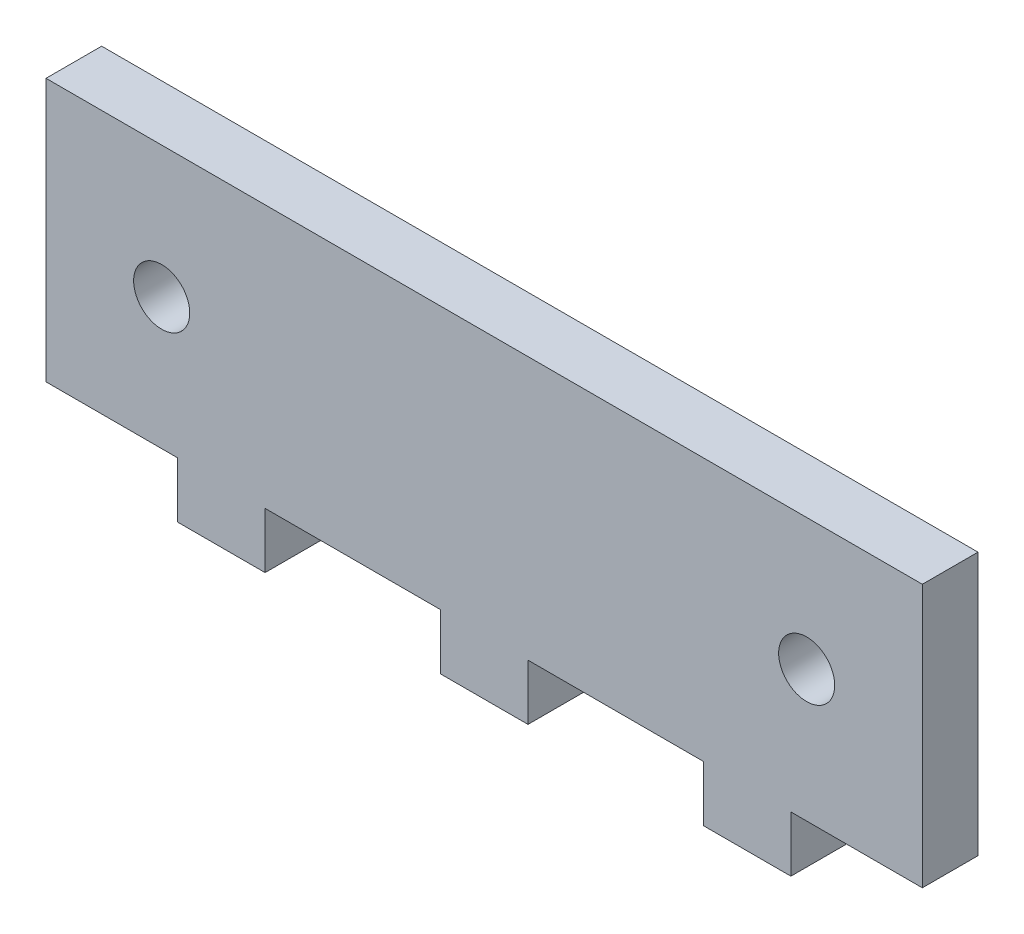
ISO-10303-21;
HEADER;
FILE_DESCRIPTION(('STEP AP214'),'2;1');
FILE_NAME('part.step','',(''),(''),'','','');
FILE_SCHEMA(('AUTOMOTIVE_DESIGN { 1 0 10303 214 1 1 1 1 }'));
ENDSEC;
DATA;
#1=APPLICATION_CONTEXT('core data for automotive mechanical design processes');
#2=APPLICATION_PROTOCOL_DEFINITION('international standard','automotive_design',2000,#1);
#3=PRODUCT_CONTEXT('',#1,'mechanical');
#4=PRODUCT('Part','Part','',(#3));
#5=PRODUCT_RELATED_PRODUCT_CATEGORY('part','',(#4));
#6=PRODUCT_DEFINITION_FORMATION('','',#4);
#7=PRODUCT_DEFINITION_CONTEXT('part definition',#1,'design');
#8=PRODUCT_DEFINITION('design','',#6,#7);
#9=PRODUCT_DEFINITION_SHAPE('','',#8);
#10=(LENGTH_UNIT() NAMED_UNIT(*) SI_UNIT(.MILLI.,.METRE.));
#11=(NAMED_UNIT(*) PLANE_ANGLE_UNIT() SI_UNIT($,.RADIAN.));
#12=(NAMED_UNIT(*) SI_UNIT($,.STERADIAN.) SOLID_ANGLE_UNIT());
#13=UNCERTAINTY_MEASURE_WITH_UNIT(LENGTH_MEASURE(1.E-05),#10,'distance_accuracy_value','');
#14=(GEOMETRIC_REPRESENTATION_CONTEXT(3) GLOBAL_UNCERTAINTY_ASSIGNED_CONTEXT((#13)) GLOBAL_UNIT_ASSIGNED_CONTEXT((#10,
#11,#12)) REPRESENTATION_CONTEXT('',''));
#15=CARTESIAN_POINT('',(0.,0.,0.));
#16=DIRECTION('',(0.,0.,1.));
#17=DIRECTION('',(1.,0.,0.));
#18=AXIS2_PLACEMENT_3D('',#15,#16,#17);
#19=CARTESIAN_POINT('',(-17.5,-7.5,3.175));
#20=DIRECTION('',(0.,1.,0.));
#21=DIRECTION('',(-1.,0.,0.));
#22=AXIS2_PLACEMENT_3D('',#19,#20,#21);
#23=PLANE('',#22);
#24=DIRECTION('',(1.,0.,0.));
#25=VECTOR('',#24,1.);
#26=CARTESIAN_POINT('',(-17.5,-7.5,0.));
#27=LINE('',#26,#25);
#28=CARTESIAN_POINT('',(-25.,-7.5,0.));
#29=VERTEX_POINT('',#28);
#30=CARTESIAN_POINT('',(-17.5,-7.5,0.));
#31=VERTEX_POINT('',#30);
#32=EDGE_CURVE('E187',#29,#31,#27,.T.);
#33=ORIENTED_EDGE('',*,*,#32,.T.);
#34=DIRECTION('',(0.,0.,-1.));
#35=VECTOR('',#34,1.);
#36=CARTESIAN_POINT('',(-17.5,-7.5,3.175));
#37=LINE('',#36,#35);
#38=CARTESIAN_POINT('',(-17.5,-7.5,3.175));
#39=VERTEX_POINT('',#38);
#40=EDGE_CURVE('E11',#39,#31,#37,.T.);
#41=ORIENTED_EDGE('',*,*,#40,.F.);
#42=DIRECTION('',(1.,0.,0.));
#43=VECTOR('',#42,1.);
#44=CARTESIAN_POINT('',(-17.5,-7.5,3.175));
#45=LINE('',#44,#43);
#46=CARTESIAN_POINT('',(-25.,-7.5,3.175));
#47=VERTEX_POINT('',#46);
#48=EDGE_CURVE('E234',#47,#39,#45,.T.);
#49=ORIENTED_EDGE('',*,*,#48,.F.);
#50=DIRECTION('',(0.,0.,-1.));
#51=VECTOR('',#50,1.);
#52=CARTESIAN_POINT('',(-25.,-7.5,3.175));
#53=LINE('',#52,#51);
#54=EDGE_CURVE('E183',#47,#29,#53,.T.);
#55=ORIENTED_EDGE('',*,*,#54,.T.);
#56=EDGE_LOOP('',(#33,#41,#49,#55));
#57=FACE_BOUND('',#56,.T.);
#58=ADVANCED_FACE('F38',(#57),#23,.F.);
#59=CARTESIAN_POINT('',(-17.5,-7.5,3.175));
#60=DIRECTION('',(1.,0.,0.));
#61=DIRECTION('',(0.,0.,-1.));
#62=AXIS2_PLACEMENT_3D('',#59,#60,#61);
#63=PLANE('',#62);
#64=DIRECTION('',(0.,-1.,0.));
#65=VECTOR('',#64,1.);
#66=CARTESIAN_POINT('',(-17.5,-7.5,0.));
#67=LINE('',#66,#65);
#68=CARTESIAN_POINT('',(-17.5,-10.675,0.));
#69=VERTEX_POINT('',#68);
#70=EDGE_CURVE('E191',#31,#69,#67,.T.);
#71=ORIENTED_EDGE('',*,*,#70,.T.);
#72=DIRECTION('',(0.,0.,-1.));
#73=VECTOR('',#72,1.);
#74=CARTESIAN_POINT('',(-17.5,-10.675,3.175));
#75=LINE('',#74,#73);
#76=CARTESIAN_POINT('',(-17.5,-10.675,3.175));
#77=VERTEX_POINT('',#76);
#78=EDGE_CURVE('E47',#77,#69,#75,.T.);
#79=ORIENTED_EDGE('',*,*,#78,.F.);
#80=DIRECTION('',(0.,-1.,0.));
#81=VECTOR('',#80,1.);
#82=CARTESIAN_POINT('',(-17.5,-7.5,3.175));
#83=LINE('',#82,#81);
#84=EDGE_CURVE('E122',#39,#77,#83,.T.);
#85=ORIENTED_EDGE('',*,*,#84,.F.);
#86=ORIENTED_EDGE('',*,*,#40,.T.);
#87=EDGE_LOOP('',(#71,#79,#85,#86));
#88=FACE_BOUND('',#87,.T.);
#89=ADVANCED_FACE('F358',(#88),#63,.F.);
#90=CARTESIAN_POINT('',(-17.5,-10.675,3.175));
#91=DIRECTION('',(0.,1.,0.));
#92=DIRECTION('',(-1.,0.,0.));
#93=AXIS2_PLACEMENT_3D('',#90,#91,#92);
#94=PLANE('',#93);
#95=DIRECTION('',(1.,0.,0.));
#96=VECTOR('',#95,1.);
#97=CARTESIAN_POINT('',(-17.5,-10.675,0.));
#98=LINE('',#97,#96);
#99=CARTESIAN_POINT('',(-12.5,-10.675,0.));
#100=VERTEX_POINT('',#99);
#101=EDGE_CURVE('E195',#69,#100,#98,.T.);
#102=ORIENTED_EDGE('',*,*,#101,.T.);
#103=DIRECTION('',(0.,0.,-1.));
#104=VECTOR('',#103,1.);
#105=CARTESIAN_POINT('',(-12.5,-10.675,3.175));
#106=LINE('',#105,#104);
#107=CARTESIAN_POINT('',(-12.5,-10.675,3.175));
#108=VERTEX_POINT('',#107);
#109=EDGE_CURVE('E277',#108,#100,#106,.T.);
#110=ORIENTED_EDGE('',*,*,#109,.F.);
#111=DIRECTION('',(1.,0.,0.));
#112=VECTOR('',#111,1.);
#113=CARTESIAN_POINT('',(-17.5,-10.675,3.175));
#114=LINE('',#113,#112);
#115=EDGE_CURVE('E287',#77,#108,#114,.T.);
#116=ORIENTED_EDGE('',*,*,#115,.F.);
#117=ORIENTED_EDGE('',*,*,#78,.T.);
#118=EDGE_LOOP('',(#102,#110,#116,#117));
#119=FACE_BOUND('',#118,.T.);
#120=ADVANCED_FACE('F285',(#119),#94,.F.);
#121=CARTESIAN_POINT('',(-12.5,-7.5,3.175));
#122=DIRECTION('',(-1.,0.,0.));
#123=DIRECTION('',(0.,0.,1.));
#124=AXIS2_PLACEMENT_3D('',#121,#122,#123);
#125=PLANE('',#124);
#126=DIRECTION('',(0.,1.,0.));
#127=VECTOR('',#126,1.);
#128=CARTESIAN_POINT('',(-12.5,-7.5,0.));
#129=LINE('',#128,#127);
#130=CARTESIAN_POINT('',(-12.5,-7.5,0.));
#131=VERTEX_POINT('',#130);
#132=EDGE_CURVE('E198',#100,#131,#129,.T.);
#133=ORIENTED_EDGE('',*,*,#132,.T.);
#134=DIRECTION('',(0.,0.,-1.));
#135=VECTOR('',#134,1.);
#136=CARTESIAN_POINT('',(-12.5,-7.5,3.175));
#137=LINE('',#136,#135);
#138=CARTESIAN_POINT('',(-12.5,-7.5,3.175));
#139=VERTEX_POINT('',#138);
#140=EDGE_CURVE('E273',#139,#131,#137,.T.);
#141=ORIENTED_EDGE('',*,*,#140,.F.);
#142=DIRECTION('',(0.,1.,0.));
#143=VECTOR('',#142,1.);
#144=CARTESIAN_POINT('',(-12.5,-7.5,3.175));
#145=LINE('',#144,#143);
#146=EDGE_CURVE('E306',#108,#139,#145,.T.);
#147=ORIENTED_EDGE('',*,*,#146,.F.);
#148=ORIENTED_EDGE('',*,*,#109,.T.);
#149=EDGE_LOOP('',(#133,#141,#147,#148));
#150=FACE_BOUND('',#149,.T.);
#151=ADVANCED_FACE('F296',(#150),#125,.F.);
#152=CARTESIAN_POINT('',(-2.49999999999998,-7.5,3.175));
#153=DIRECTION('',(0.,1.,0.));
#154=DIRECTION('',(-1.,0.,0.));
#155=AXIS2_PLACEMENT_3D('',#152,#153,#154);
#156=PLANE('',#155);
#157=DIRECTION('',(1.,0.,0.));
#158=VECTOR('',#157,1.);
#159=CARTESIAN_POINT('',(-2.49999999999998,-7.5,0.));
#160=LINE('',#159,#158);
#161=CARTESIAN_POINT('',(-2.49999999999998,-7.5,0.));
#162=VERTEX_POINT('',#161);
#163=EDGE_CURVE('E201',#131,#162,#160,.T.);
#164=ORIENTED_EDGE('',*,*,#163,.T.);
#165=DIRECTION('',(0.,0.,-1.));
#166=VECTOR('',#165,1.);
#167=CARTESIAN_POINT('',(-2.49999999999998,-7.5,3.175));
#168=LINE('',#167,#166);
#169=CARTESIAN_POINT('',(-2.49999999999998,-7.5,3.175));
#170=VERTEX_POINT('',#169);
#171=EDGE_CURVE('E269',#170,#162,#168,.T.);
#172=ORIENTED_EDGE('',*,*,#171,.F.);
#173=DIRECTION('',(1.,0.,0.));
#174=VECTOR('',#173,1.);
#175=CARTESIAN_POINT('',(-2.49999999999998,-7.5,3.175));
#176=LINE('',#175,#174);
#177=EDGE_CURVE('E302',#139,#170,#176,.T.);
#178=ORIENTED_EDGE('',*,*,#177,.F.);
#179=ORIENTED_EDGE('',*,*,#140,.T.);
#180=EDGE_LOOP('',(#164,#172,#178,#179));
#181=FACE_BOUND('',#180,.T.);
#182=ADVANCED_FACE('F300',(#181),#156,.F.);
#183=CARTESIAN_POINT('',(-2.49999999999998,-7.5,3.175));
#184=DIRECTION('',(1.,0.,0.));
#185=DIRECTION('',(0.,1.,0.));
#186=AXIS2_PLACEMENT_3D('',#183,#184,#185);
#187=PLANE('',#186);
#188=DIRECTION('',(0.,-1.,0.));
#189=VECTOR('',#188,1.);
#190=CARTESIAN_POINT('',(-2.49999999999998,-7.5,0.));
#191=LINE('',#190,#189);
#192=CARTESIAN_POINT('',(-2.49999999999998,-10.675,0.));
#193=VERTEX_POINT('',#192);
#194=EDGE_CURVE('E204',#162,#193,#191,.T.);
#195=ORIENTED_EDGE('',*,*,#194,.T.);
#196=DIRECTION('',(0.,0.,-1.));
#197=VECTOR('',#196,1.);
#198=CARTESIAN_POINT('',(-2.49999999999998,-10.675,3.175));
#199=LINE('',#198,#197);
#200=CARTESIAN_POINT('',(-2.49999999999998,-10.675,3.175));
#201=VERTEX_POINT('',#200);
#202=EDGE_CURVE('E265',#201,#193,#199,.T.);
#203=ORIENTED_EDGE('',*,*,#202,.F.);
#204=DIRECTION('',(0.,-1.,0.));
#205=VECTOR('',#204,1.);
#206=CARTESIAN_POINT('',(-2.49999999999998,-7.5,3.175));
#207=LINE('',#206,#205);
#208=EDGE_CURVE('E305',#170,#201,#207,.T.);
#209=ORIENTED_EDGE('',*,*,#208,.F.);
#210=ORIENTED_EDGE('',*,*,#171,.T.);
#211=EDGE_LOOP('',(#195,#203,#209,#210));
#212=FACE_BOUND('',#211,.T.);
#213=ADVANCED_FACE('F371',(#212),#187,.F.);
#214=CARTESIAN_POINT('',(-2.49999999999998,-10.675,3.175));
#215=DIRECTION('',(0.,1.,0.));
#216=DIRECTION('',(-1.,0.,0.));
#217=AXIS2_PLACEMENT_3D('',#214,#215,#216);
#218=PLANE('',#217);
#219=DIRECTION('',(1.,0.,0.));
#220=VECTOR('',#219,1.);
#221=CARTESIAN_POINT('',(-2.49999999999998,-10.675,0.));
#222=LINE('',#221,#220);
#223=CARTESIAN_POINT('',(2.50000000000002,-10.675,0.));
#224=VERTEX_POINT('',#223);
#225=EDGE_CURVE('E207',#193,#224,#222,.T.);
#226=ORIENTED_EDGE('',*,*,#225,.T.);
#227=DIRECTION('',(0.,0.,-1.));
#228=VECTOR('',#227,1.);
#229=CARTESIAN_POINT('',(2.50000000000002,-10.675,3.175));
#230=LINE('',#229,#228);
#231=CARTESIAN_POINT('',(2.50000000000002,-10.675,3.175));
#232=VERTEX_POINT('',#231);
#233=EDGE_CURVE('E261',#232,#224,#230,.T.);
#234=ORIENTED_EDGE('',*,*,#233,.F.);
#235=DIRECTION('',(1.,0.,0.));
#236=VECTOR('',#235,1.);
#237=CARTESIAN_POINT('',(-2.49999999999998,-10.675,3.175));
#238=LINE('',#237,#236);
#239=EDGE_CURVE('E310',#201,#232,#238,.T.);
#240=ORIENTED_EDGE('',*,*,#239,.F.);
#241=ORIENTED_EDGE('',*,*,#202,.T.);
#242=EDGE_LOOP('',(#226,#234,#240,#241));
#243=FACE_BOUND('',#242,.T.);
#244=ADVANCED_FACE('F374',(#243),#218,.F.);
#245=CARTESIAN_POINT('',(2.50000000000002,-7.5,3.175));
#246=DIRECTION('',(-1.,0.,0.));
#247=DIRECTION('',(0.,-1.,0.));
#248=AXIS2_PLACEMENT_3D('',#245,#246,#247);
#249=PLANE('',#248);
#250=DIRECTION('',(0.,1.,0.));
#251=VECTOR('',#250,1.);
#252=CARTESIAN_POINT('',(2.50000000000002,-7.5,0.));
#253=LINE('',#252,#251);
#254=CARTESIAN_POINT('',(2.50000000000002,-7.5,0.));
#255=VERTEX_POINT('',#254);
#256=EDGE_CURVE('E210',#224,#255,#253,.T.);
#257=ORIENTED_EDGE('',*,*,#256,.T.);
#258=DIRECTION('',(0.,0.,-1.));
#259=VECTOR('',#258,1.);
#260=CARTESIAN_POINT('',(2.50000000000002,-7.5,3.175));
#261=LINE('',#260,#259);
#262=CARTESIAN_POINT('',(2.50000000000002,-7.5,3.175));
#263=VERTEX_POINT('',#262);
#264=EDGE_CURVE('E257',#263,#255,#261,.T.);
#265=ORIENTED_EDGE('',*,*,#264,.F.);
#266=DIRECTION('',(0.,1.,0.));
#267=VECTOR('',#266,1.);
#268=CARTESIAN_POINT('',(2.50000000000002,-7.5,3.175));
#269=LINE('',#268,#267);
#270=EDGE_CURVE('E317',#232,#263,#269,.T.);
#271=ORIENTED_EDGE('',*,*,#270,.F.);
#272=ORIENTED_EDGE('',*,*,#233,.T.);
#273=EDGE_LOOP('',(#257,#265,#271,#272));
#274=FACE_BOUND('',#273,.T.);
#275=ADVANCED_FACE('F378',(#274),#249,.F.);
#276=CARTESIAN_POINT('',(12.5,-7.5,3.175));
#277=DIRECTION('',(0.,1.,0.));
#278=DIRECTION('',(-1.,0.,0.));
#279=AXIS2_PLACEMENT_3D('',#276,#277,#278);
#280=PLANE('',#279);
#281=DIRECTION('',(1.,0.,0.));
#282=VECTOR('',#281,1.);
#283=CARTESIAN_POINT('',(12.5,-7.5,0.));
#284=LINE('',#283,#282);
#285=CARTESIAN_POINT('',(12.5,-7.5,0.));
#286=VERTEX_POINT('',#285);
#287=EDGE_CURVE('E213',#255,#286,#284,.T.);
#288=ORIENTED_EDGE('',*,*,#287,.T.);
#289=DIRECTION('',(0.,0.,-1.));
#290=VECTOR('',#289,1.);
#291=CARTESIAN_POINT('',(12.5,-7.5,3.175));
#292=LINE('',#291,#290);
#293=CARTESIAN_POINT('',(12.5,-7.5,3.175));
#294=VERTEX_POINT('',#293);
#295=EDGE_CURVE('E253',#294,#286,#292,.T.);
#296=ORIENTED_EDGE('',*,*,#295,.F.);
#297=DIRECTION('',(1.,0.,0.));
#298=VECTOR('',#297,1.);
#299=CARTESIAN_POINT('',(12.5,-7.5,3.175));
#300=LINE('',#299,#298);
#301=EDGE_CURVE('E320',#263,#294,#300,.T.);
#302=ORIENTED_EDGE('',*,*,#301,.F.);
#303=ORIENTED_EDGE('',*,*,#264,.T.);
#304=EDGE_LOOP('',(#288,#296,#302,#303));
#305=FACE_BOUND('',#304,.T.);
#306=ADVANCED_FACE('F382',(#305),#280,.F.);
#307=CARTESIAN_POINT('',(12.5,-7.5,3.175));
#308=DIRECTION('',(1.,0.,0.));
#309=DIRECTION('',(0.,0.,-1.));
#310=AXIS2_PLACEMENT_3D('',#307,#308,#309);
#311=PLANE('',#310);
#312=DIRECTION('',(0.,-1.,0.));
#313=VECTOR('',#312,1.);
#314=CARTESIAN_POINT('',(12.5,-7.5,0.));
#315=LINE('',#314,#313);
#316=CARTESIAN_POINT('',(12.5,-10.675,0.));
#317=VERTEX_POINT('',#316);
#318=EDGE_CURVE('E216',#286,#317,#315,.T.);
#319=ORIENTED_EDGE('',*,*,#318,.T.);
#320=DIRECTION('',(0.,0.,-1.));
#321=VECTOR('',#320,1.);
#322=CARTESIAN_POINT('',(12.5,-10.675,3.175));
#323=LINE('',#322,#321);
#324=CARTESIAN_POINT('',(12.5,-10.675,3.175));
#325=VERTEX_POINT('',#324);
#326=EDGE_CURVE('E249',#325,#317,#323,.T.);
#327=ORIENTED_EDGE('',*,*,#326,.F.);
#328=DIRECTION('',(0.,-1.,0.));
#329=VECTOR('',#328,1.);
#330=CARTESIAN_POINT('',(12.5,-7.5,3.175));
#331=LINE('',#330,#329);
#332=EDGE_CURVE('E323',#294,#325,#331,.T.);
#333=ORIENTED_EDGE('',*,*,#332,.F.);
#334=ORIENTED_EDGE('',*,*,#295,.T.);
#335=EDGE_LOOP('',(#319,#327,#333,#334));
#336=FACE_BOUND('',#335,.T.);
#337=ADVANCED_FACE('F386',(#336),#311,.F.);
#338=CARTESIAN_POINT('',(12.5,-10.675,3.175));
#339=DIRECTION('',(0.,1.,0.));
#340=DIRECTION('',(0.,0.,1.));
#341=AXIS2_PLACEMENT_3D('',#338,#339,#340);
#342=PLANE('',#341);
#343=DIRECTION('',(1.,0.,0.));
#344=VECTOR('',#343,1.);
#345=CARTESIAN_POINT('',(12.5,-10.675,0.));
#346=LINE('',#345,#344);
#347=CARTESIAN_POINT('',(17.5,-10.675,0.));
#348=VERTEX_POINT('',#347);
#349=EDGE_CURVE('E219',#317,#348,#346,.T.);
#350=ORIENTED_EDGE('',*,*,#349,.T.);
#351=DIRECTION('',(0.,0.,-1.));
#352=VECTOR('',#351,1.);
#353=CARTESIAN_POINT('',(17.5,-10.675,3.175));
#354=LINE('',#353,#352);
#355=CARTESIAN_POINT('',(17.5,-10.675,3.175));
#356=VERTEX_POINT('',#355);
#357=EDGE_CURVE('E245',#356,#348,#354,.T.);
#358=ORIENTED_EDGE('',*,*,#357,.F.);
#359=DIRECTION('',(1.,0.,0.));
#360=VECTOR('',#359,1.);
#361=CARTESIAN_POINT('',(12.5,-10.675,3.175));
#362=LINE('',#361,#360);
#363=EDGE_CURVE('E326',#325,#356,#362,.T.);
#364=ORIENTED_EDGE('',*,*,#363,.F.);
#365=ORIENTED_EDGE('',*,*,#326,.T.);
#366=EDGE_LOOP('',(#350,#358,#364,#365));
#367=FACE_BOUND('',#366,.T.);
#368=ADVANCED_FACE('F390',(#367),#342,.F.);
#369=CARTESIAN_POINT('',(17.5,-7.5,3.175));
#370=DIRECTION('',(-1.,0.,0.));
#371=DIRECTION('',(0.,-1.,0.));
#372=AXIS2_PLACEMENT_3D('',#369,#370,#371);
#373=PLANE('',#372);
#374=DIRECTION('',(0.,1.,0.));
#375=VECTOR('',#374,1.);
#376=CARTESIAN_POINT('',(17.5,-7.5,0.));
#377=LINE('',#376,#375);
#378=CARTESIAN_POINT('',(17.5,-7.5,0.));
#379=VERTEX_POINT('',#378);
#380=EDGE_CURVE('E222',#348,#379,#377,.T.);
#381=ORIENTED_EDGE('',*,*,#380,.T.);
#382=DIRECTION('',(0.,0.,-1.));
#383=VECTOR('',#382,1.);
#384=CARTESIAN_POINT('',(17.5,-7.5,3.175));
#385=LINE('',#384,#383);
#386=CARTESIAN_POINT('',(17.5,-7.5,3.175));
#387=VERTEX_POINT('',#386);
#388=EDGE_CURVE('E241',#387,#379,#385,.T.);
#389=ORIENTED_EDGE('',*,*,#388,.F.);
#390=DIRECTION('',(0.,1.,0.));
#391=VECTOR('',#390,1.);
#392=CARTESIAN_POINT('',(17.5,-7.5,3.175));
#393=LINE('',#392,#391);
#394=EDGE_CURVE('E329',#356,#387,#393,.T.);
#395=ORIENTED_EDGE('',*,*,#394,.F.);
#396=ORIENTED_EDGE('',*,*,#357,.T.);
#397=EDGE_LOOP('',(#381,#389,#395,#396));
#398=FACE_BOUND('',#397,.T.);
#399=ADVANCED_FACE('F337',(#398),#373,.F.);
#400=CARTESIAN_POINT('',(25.,-7.5,3.175));
#401=DIRECTION('',(0.,1.,0.));
#402=DIRECTION('',(-1.,0.,0.));
#403=AXIS2_PLACEMENT_3D('',#400,#401,#402);
#404=PLANE('',#403);
#405=DIRECTION('',(1.,0.,0.));
#406=VECTOR('',#405,1.);
#407=CARTESIAN_POINT('',(25.,-7.5,0.));
#408=LINE('',#407,#406);
#409=CARTESIAN_POINT('',(25.,-7.5,0.));
#410=VERTEX_POINT('',#409);
#411=EDGE_CURVE('E225',#379,#410,#408,.T.);
#412=ORIENTED_EDGE('',*,*,#411,.T.);
#413=DIRECTION('',(0.,0.,-1.));
#414=VECTOR('',#413,1.);
#415=CARTESIAN_POINT('',(25.,-7.5,3.175));
#416=LINE('',#415,#414);
#417=CARTESIAN_POINT('',(25.,-7.5,3.175));
#418=VERTEX_POINT('',#417);
#419=EDGE_CURVE('E176',#418,#410,#416,.T.);
#420=ORIENTED_EDGE('',*,*,#419,.F.);
#421=DIRECTION('',(1.,0.,0.));
#422=VECTOR('',#421,1.);
#423=CARTESIAN_POINT('',(25.,-7.5,3.175));
#424=LINE('',#423,#422);
#425=EDGE_CURVE('E165',#387,#418,#424,.T.);
#426=ORIENTED_EDGE('',*,*,#425,.F.);
#427=ORIENTED_EDGE('',*,*,#388,.T.);
#428=EDGE_LOOP('',(#412,#420,#426,#427));
#429=FACE_BOUND('',#428,.T.);
#430=ADVANCED_FACE('F341',(#429),#404,.F.);
#431=CARTESIAN_POINT('',(25.,7.5,3.175));
#432=DIRECTION('',(-1.,0.,0.));
#433=DIRECTION('',(0.,-1.,0.));
#434=AXIS2_PLACEMENT_3D('',#431,#432,#433);
#435=PLANE('',#434);
#436=DIRECTION('',(0.,1.,0.));
#437=VECTOR('',#436,1.);
#438=CARTESIAN_POINT('',(25.,7.5,0.));
#439=LINE('',#438,#437);
#440=CARTESIAN_POINT('',(25.,7.5,0.));
#441=VERTEX_POINT('',#440);
#442=EDGE_CURVE('E174',#410,#441,#439,.T.);
#443=ORIENTED_EDGE('',*,*,#442,.T.);
#444=DIRECTION('',(0.,0.,-1.));
#445=VECTOR('',#444,1.);
#446=CARTESIAN_POINT('',(25.,7.5,3.175));
#447=LINE('',#446,#445);
#448=CARTESIAN_POINT('',(25.,7.5,3.175));
#449=VERTEX_POINT('',#448);
#450=EDGE_CURVE('E171',#449,#441,#447,.T.);
#451=ORIENTED_EDGE('',*,*,#450,.F.);
#452=DIRECTION('',(0.,1.,0.));
#453=VECTOR('',#452,1.);
#454=CARTESIAN_POINT('',(25.,7.5,3.175));
#455=LINE('',#454,#453);
#456=EDGE_CURVE('E159',#418,#449,#455,.T.);
#457=ORIENTED_EDGE('',*,*,#456,.F.);
#458=ORIENTED_EDGE('',*,*,#419,.T.);
#459=EDGE_LOOP('',(#443,#451,#457,#458));
#460=FACE_BOUND('',#459,.T.);
#461=ADVANCED_FACE('F172',(#460),#435,.F.);
#462=CARTESIAN_POINT('',(25.,7.5,3.175));
#463=DIRECTION('',(0.,-1.,0.));
#464=DIRECTION('',(1.,0.,0.));
#465=AXIS2_PLACEMENT_3D('',#462,#463,#464);
#466=PLANE('',#465);
#467=DIRECTION('',(-1.,0.,0.));
#468=VECTOR('',#467,1.);
#469=CARTESIAN_POINT('',(25.,7.5,0.));
#470=LINE('',#469,#468);
#471=CARTESIAN_POINT('',(-25.,7.5,0.));
#472=VERTEX_POINT('',#471);
#473=EDGE_CURVE('E108',#441,#472,#470,.T.);
#474=ORIENTED_EDGE('',*,*,#473,.T.);
#475=DIRECTION('',(0.,0.,-1.));
#476=VECTOR('',#475,1.);
#477=CARTESIAN_POINT('',(-25.,7.5,3.175));
#478=LINE('',#477,#476);
#479=CARTESIAN_POINT('',(-25.,7.5,3.175));
#480=VERTEX_POINT('',#479);
#481=EDGE_CURVE('E177',#480,#472,#478,.T.);
#482=ORIENTED_EDGE('',*,*,#481,.F.);
#483=DIRECTION('',(-1.,0.,0.));
#484=VECTOR('',#483,1.);
#485=CARTESIAN_POINT('',(25.,7.5,3.175));
#486=LINE('',#485,#484);
#487=EDGE_CURVE('E163',#449,#480,#486,.T.);
#488=ORIENTED_EDGE('',*,*,#487,.F.);
#489=ORIENTED_EDGE('',*,*,#450,.T.);
#490=EDGE_LOOP('',(#474,#482,#488,#489));
#491=FACE_BOUND('',#490,.T.);
#492=ADVANCED_FACE('F179',(#491),#466,.F.);
#493=CARTESIAN_POINT('',(-25.,7.5,3.175));
#494=DIRECTION('',(1.,0.,0.));
#495=DIRECTION('',(0.,0.,-1.));
#496=AXIS2_PLACEMENT_3D('',#493,#494,#495);
#497=PLANE('',#496);
#498=DIRECTION('',(0.,-1.,0.));
#499=VECTOR('',#498,1.);
#500=CARTESIAN_POINT('',(-25.,7.5,0.));
#501=LINE('',#500,#499);
#502=EDGE_CURVE('E114',#472,#29,#501,.T.);
#503=ORIENTED_EDGE('',*,*,#502,.T.);
#504=ORIENTED_EDGE('',*,*,#54,.F.);
#505=DIRECTION('',(0.,-1.,0.));
#506=VECTOR('',#505,1.);
#507=CARTESIAN_POINT('',(-25.,7.5,3.175));
#508=LINE('',#507,#506);
#509=EDGE_CURVE('E55',#480,#47,#508,.T.);
#510=ORIENTED_EDGE('',*,*,#509,.F.);
#511=ORIENTED_EDGE('',*,*,#481,.T.);
#512=EDGE_LOOP('',(#503,#504,#510,#511));
#513=FACE_BOUND('',#512,.T.);
#514=ADVANCED_FACE('F345',(#513),#497,.F.);
#515=CARTESIAN_POINT('',(0.,0.,3.175));
#516=DIRECTION('',(0.,0.,1.));
#517=DIRECTION('',(1.,0.,0.));
#518=AXIS2_PLACEMENT_3D('',#515,#516,#517);
#519=PLANE('',#518);
#520=CARTESIAN_POINT('',(-18.4,0.,3.175));
#521=DIRECTION('',(0.,0.,1.));
#522=DIRECTION('',(1.,0.,0.));
#523=AXIS2_PLACEMENT_3D('',#520,#521,#522);
#524=CIRCLE('',#523,1.60000000000001);
#525=CARTESIAN_POINT('',(-16.8,0.,3.175));
#526=VERTEX_POINT('',#525);
#527=EDGE_CURVE('E450',#526,#526,#524,.T.);
#528=ORIENTED_EDGE('',*,*,#527,.F.);
#529=EDGE_LOOP('',(#528));
#530=FACE_BOUND('',#529,.T.);
#531=CARTESIAN_POINT('',(18.4,0.,3.175));
#532=DIRECTION('',(0.,0.,1.));
#533=DIRECTION('',(1.,0.,0.));
#534=AXIS2_PLACEMENT_3D('',#531,#532,#533);
#535=CIRCLE('',#534,1.6);
#536=CARTESIAN_POINT('',(20.,0.,3.175));
#537=VERTEX_POINT('',#536);
#538=EDGE_CURVE('E458',#537,#537,#535,.T.);
#539=ORIENTED_EDGE('',*,*,#538,.F.);
#540=EDGE_LOOP('',(#539));
#541=FACE_BOUND('',#540,.T.);
#542=ORIENTED_EDGE('',*,*,#48,.T.);
#543=ORIENTED_EDGE('',*,*,#84,.T.);
#544=ORIENTED_EDGE('',*,*,#115,.T.);
#545=ORIENTED_EDGE('',*,*,#146,.T.);
#546=ORIENTED_EDGE('',*,*,#177,.T.);
#547=ORIENTED_EDGE('',*,*,#208,.T.);
#548=ORIENTED_EDGE('',*,*,#239,.T.);
#549=ORIENTED_EDGE('',*,*,#270,.T.);
#550=ORIENTED_EDGE('',*,*,#301,.T.);
#551=ORIENTED_EDGE('',*,*,#332,.T.);
#552=ORIENTED_EDGE('',*,*,#363,.T.);
#553=ORIENTED_EDGE('',*,*,#394,.T.);
#554=ORIENTED_EDGE('',*,*,#425,.T.);
#555=ORIENTED_EDGE('',*,*,#456,.T.);
#556=ORIENTED_EDGE('',*,*,#487,.T.);
#557=ORIENTED_EDGE('',*,*,#509,.T.);
#558=EDGE_LOOP('',(#542,#543,#544,#545,#546,#547,#548,#549,#550,#551,#552,#553,#554,#555,#556,#557));
#559=FACE_BOUND('',#558,.T.);
#560=ADVANCED_FACE('F161',(#530,#541,#559),#519,.T.);
#561=CARTESIAN_POINT('',(0.,0.,0.));
#562=DIRECTION('',(0.,0.,1.));
#563=DIRECTION('',(1.,0.,0.));
#564=AXIS2_PLACEMENT_3D('',#561,#562,#563);
#565=PLANE('',#564);
#566=CARTESIAN_POINT('',(-18.4,0.,0.));
#567=DIRECTION('',(0.,0.,1.));
#568=DIRECTION('',(1.,0.,0.));
#569=AXIS2_PLACEMENT_3D('',#566,#567,#568);
#570=CIRCLE('',#569,1.60000000000001);
#571=CARTESIAN_POINT('',(-16.8,0.,0.));
#572=VERTEX_POINT('',#571);
#573=EDGE_CURVE('E192',#572,#572,#570,.T.);
#574=ORIENTED_EDGE('',*,*,#573,.T.);
#575=EDGE_LOOP('',(#574));
#576=FACE_BOUND('',#575,.T.);
#577=CARTESIAN_POINT('',(18.4,0.,0.));
#578=DIRECTION('',(0.,0.,1.));
#579=DIRECTION('',(1.,0.,0.));
#580=AXIS2_PLACEMENT_3D('',#577,#578,#579);
#581=CIRCLE('',#580,1.6);
#582=CARTESIAN_POINT('',(20.,0.,0.));
#583=VERTEX_POINT('',#582);
#584=EDGE_CURVE('E452',#583,#583,#581,.T.);
#585=ORIENTED_EDGE('',*,*,#584,.T.);
#586=EDGE_LOOP('',(#585));
#587=FACE_BOUND('',#586,.T.);
#588=ORIENTED_EDGE('',*,*,#32,.F.);
#589=ORIENTED_EDGE('',*,*,#502,.F.);
#590=ORIENTED_EDGE('',*,*,#473,.F.);
#591=ORIENTED_EDGE('',*,*,#442,.F.);
#592=ORIENTED_EDGE('',*,*,#411,.F.);
#593=ORIENTED_EDGE('',*,*,#380,.F.);
#594=ORIENTED_EDGE('',*,*,#349,.F.);
#595=ORIENTED_EDGE('',*,*,#318,.F.);
#596=ORIENTED_EDGE('',*,*,#287,.F.);
#597=ORIENTED_EDGE('',*,*,#256,.F.);
#598=ORIENTED_EDGE('',*,*,#225,.F.);
#599=ORIENTED_EDGE('',*,*,#194,.F.);
#600=ORIENTED_EDGE('',*,*,#163,.F.);
#601=ORIENTED_EDGE('',*,*,#132,.F.);
#602=ORIENTED_EDGE('',*,*,#101,.F.);
#603=ORIENTED_EDGE('',*,*,#70,.F.);
#604=EDGE_LOOP('',(#588,#589,#590,#591,#592,#593,#594,#595,#596,#597,#598,#599,#600,#601,#602,#603));
#605=FACE_BOUND('',#604,.T.);
#606=ADVANCED_FACE('F291',(#576,#587,#605),#565,.F.);
#607=CARTESIAN_POINT('',(18.4,0.,0.));
#608=DIRECTION('',(0.,0.,1.));
#609=DIRECTION('',(1.,0.,0.));
#610=AXIS2_PLACEMENT_3D('',#607,#608,#609);
#611=CYLINDRICAL_SURFACE('',#610,1.6);
#612=ORIENTED_EDGE('',*,*,#584,.F.);
#613=EDGE_LOOP('',(#612));
#614=FACE_BOUND('',#613,.T.);
#615=ORIENTED_EDGE('',*,*,#538,.T.);
#616=EDGE_LOOP('',(#615));
#617=FACE_BOUND('',#616,.T.);
#618=ADVANCED_FACE('F423',(#614,#617),#611,.F.);
#619=CARTESIAN_POINT('',(-18.4,0.,0.));
#620=DIRECTION('',(0.,0.,1.));
#621=DIRECTION('',(1.,0.,0.));
#622=AXIS2_PLACEMENT_3D('',#619,#620,#621);
#623=CYLINDRICAL_SURFACE('',#622,1.60000000000001);
#624=ORIENTED_EDGE('',*,*,#573,.F.);
#625=EDGE_LOOP('',(#624));
#626=FACE_BOUND('',#625,.T.);
#627=ORIENTED_EDGE('',*,*,#527,.T.);
#628=EDGE_LOOP('',(#627));
#629=FACE_BOUND('',#628,.T.);
#630=ADVANCED_FACE('F431',(#626,#629),#623,.F.);
#631=CLOSED_SHELL('',(#58,#89,#120,#151,#182,#213,#244,#275,#306,#337,#368,#399,#430,#461,#492,
#514,#560,#606,#618,#630));
#632=MANIFOLD_SOLID_BREP('B2',#631);
#633=ADVANCED_BREP_SHAPE_REPRESENTATION('',(#18,#632),#14);
#634=SHAPE_DEFINITION_REPRESENTATION(#9,#633);
ENDSEC;
END-ISO-10303-21;
